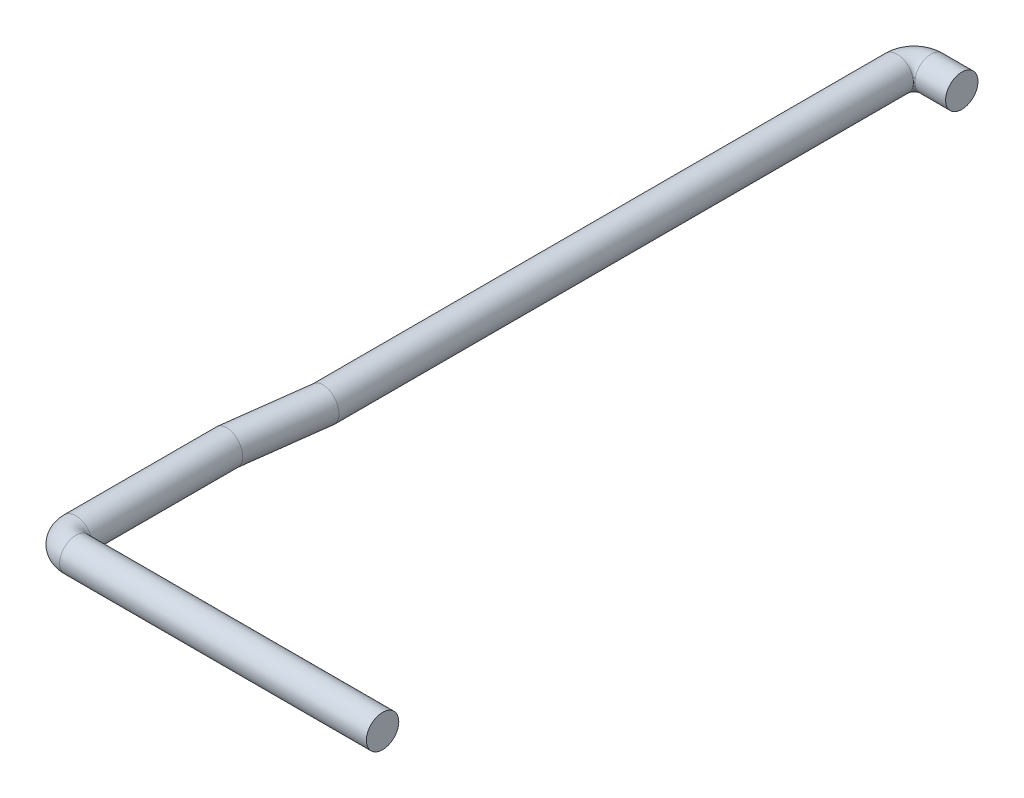
ISO-10303-21;
HEADER;
FILE_DESCRIPTION(('STEP AP214'),'2;1');
FILE_NAME('part.step','',(''),(''),'','','');
FILE_SCHEMA(('AUTOMOTIVE_DESIGN { 1 0 10303 214 1 1 1 1 }'));
ENDSEC;
DATA;
#1=APPLICATION_CONTEXT('core data for automotive mechanical design processes');
#2=APPLICATION_PROTOCOL_DEFINITION('international standard','automotive_design',2000,#1);
#3=PRODUCT_CONTEXT('',#1,'mechanical');
#4=PRODUCT('Part','Part','',(#3));
#5=PRODUCT_RELATED_PRODUCT_CATEGORY('part','',(#4));
#6=PRODUCT_DEFINITION_FORMATION('','',#4);
#7=PRODUCT_DEFINITION_CONTEXT('part definition',#1,'design');
#8=PRODUCT_DEFINITION('design','',#6,#7);
#9=PRODUCT_DEFINITION_SHAPE('','',#8);
#10=(LENGTH_UNIT() NAMED_UNIT(*) SI_UNIT(.MILLI.,.METRE.));
#11=(NAMED_UNIT(*) PLANE_ANGLE_UNIT() SI_UNIT($,.RADIAN.));
#12=(NAMED_UNIT(*) SI_UNIT($,.STERADIAN.) SOLID_ANGLE_UNIT());
#13=UNCERTAINTY_MEASURE_WITH_UNIT(LENGTH_MEASURE(1.E-05),#10,'distance_accuracy_value','');
#14=(GEOMETRIC_REPRESENTATION_CONTEXT(3) GLOBAL_UNCERTAINTY_ASSIGNED_CONTEXT((#13)) GLOBAL_UNIT_ASSIGNED_CONTEXT((#10,
#11,#12)) REPRESENTATION_CONTEXT('',''));
#15=CARTESIAN_POINT('',(0.,0.,0.));
#16=DIRECTION('',(0.,0.,1.));
#17=DIRECTION('',(1.,0.,0.));
#18=AXIS2_PLACEMENT_3D('',#15,#16,#17);
#19=CARTESIAN_POINT('',(-20.0210974306134,13.2106145917647,-0.696707328205521));
#20=DIRECTION('',(0.,-1.,0.));
#21=DIRECTION('',(0.707106781186548,0.,0.707106781186548));
#22=AXIS2_PLACEMENT_3D('',#19,#20,#21);
#23=TOROIDAL_SURFACE('',#22,0.104180843012458,0.0999);
#24=CARTESIAN_POINT('',(-20.0210974306134,13.2106145917647,-0.592526485193063));
#25=DIRECTION('',(-1.,0.,0.));
#26=DIRECTION('',(0.,0.,1.));
#27=AXIS2_PLACEMENT_3D('',#24,#25,#26);
#28=CIRCLE('',#27,0.0999);
#29=CARTESIAN_POINT('',(-20.0210974306134,13.2106145917647,-0.692426485193064));
#30=VERTEX_POINT('',#29);
#31=EDGE_CURVE('E11',#30,#30,#28,.T.);
#32=ORIENTED_EDGE('',*,*,#31,.T.);
#33=EDGE_LOOP('',(#32));
#34=FACE_BOUND('',#33,.T.);
#35=CARTESIAN_POINT('',(-20.1252782736259,13.2106145917647,-0.696707328205516));
#36=DIRECTION('',(0.,0.,-1.));
#37=DIRECTION('',(-1.,0.,0.));
#38=AXIS2_PLACEMENT_3D('',#35,#36,#37);
#39=CIRCLE('',#38,0.0999);
#40=CARTESIAN_POINT('',(-20.0253782736259,13.2106145917647,-0.696707328205519));
#41=VERTEX_POINT('',#40);
#42=EDGE_CURVE('E69',#41,#41,#39,.T.);
#43=ORIENTED_EDGE('',*,*,#42,.F.);
#44=EDGE_LOOP('',(#43));
#45=FACE_BOUND('',#44,.T.);
#46=ADVANCED_FACE('F16',(#34,#45),#23,.T.);
#47=CARTESIAN_POINT('',(-19.9532815094506,13.2106145917647,-5.68973927889833));
#48=DIRECTION('',(0.,-1.,0.));
#49=DIRECTION('',(0.707106781186548,0.,0.707106781186548));
#50=AXIS2_PLACEMENT_3D('',#47,#48,#49);
#51=TOROIDAL_SURFACE('',#50,0.104180843012454,0.0999);
#52=CARTESIAN_POINT('',(-20.0574623524631,13.2106145917647,-5.68973927889833));
#53=DIRECTION('',(0.,0.,1.));
#54=DIRECTION('',(-1.,0.,0.));
#55=AXIS2_PLACEMENT_3D('',#52,#53,#54);
#56=CIRCLE('',#55,0.0999);
#57=CARTESIAN_POINT('',(-19.9575623524631,13.2106145917647,-5.68973927889833));
#58=VERTEX_POINT('',#57);
#59=EDGE_CURVE('E62',#58,#58,#56,.T.);
#60=ORIENTED_EDGE('',*,*,#59,.F.);
#61=EDGE_LOOP('',(#60));
#62=FACE_BOUND('',#61,.T.);
#63=CARTESIAN_POINT('',(-19.9532815094506,13.2106145917647,-5.79392012191078));
#64=DIRECTION('',(-1.,0.,0.));
#65=DIRECTION('',(0.,0.,-1.));
#66=AXIS2_PLACEMENT_3D('',#63,#64,#65);
#67=CIRCLE('',#66,0.0999);
#68=CARTESIAN_POINT('',(-19.9532815094506,13.2106145917647,-5.69402012191078));
#69=VERTEX_POINT('',#68);
#70=EDGE_CURVE('E26',#69,#69,#67,.T.);
#71=ORIENTED_EDGE('',*,*,#70,.T.);
#72=EDGE_LOOP('',(#71));
#73=FACE_BOUND('',#72,.T.);
#74=ADVANCED_FACE('F100',(#62,#73),#51,.T.);
#75=CARTESIAN_POINT('',(-20.0210974306134,13.2106145917647,-0.592526485193063));
#76=DIRECTION('',(1.,0.,0.));
#77=DIRECTION('',(0.,0.,-1.));
#78=AXIS2_PLACEMENT_3D('',#75,#76,#77);
#79=CYLINDRICAL_SURFACE('',#78,0.0999);
#80=ORIENTED_EDGE('',*,*,#31,.F.);
#81=EDGE_LOOP('',(#80));
#82=FACE_BOUND('',#81,.T.);
#83=CARTESIAN_POINT('',(-18.1310974306134,13.2106145917647,-0.592526485193063));
#84=DIRECTION('',(-1.,0.,0.));
#85=DIRECTION('',(0.,0.,1.));
#86=AXIS2_PLACEMENT_3D('',#83,#84,#85);
#87=CIRCLE('',#86,0.0999);
#88=CARTESIAN_POINT('',(-18.1310974306134,13.2106145917647,-0.692426485193063));
#89=VERTEX_POINT('',#88);
#90=EDGE_CURVE('E72',#89,#89,#87,.T.);
#91=ORIENTED_EDGE('',*,*,#90,.T.);
#92=EDGE_LOOP('',(#91));
#93=FACE_BOUND('',#92,.T.);
#94=ADVANCED_FACE('F106',(#82,#93),#79,.T.);
#95=CARTESIAN_POINT('',(-20.1252782736259,13.2106145917647,-0.696707328205516));
#96=DIRECTION('',(0.,0.,-1.));
#97=DIRECTION('',(-1.,0.,0.));
#98=AXIS2_PLACEMENT_3D('',#95,#96,#97);
#99=CYLINDRICAL_SURFACE('',#98,0.0999);
#100=ORIENTED_EDGE('',*,*,#42,.T.);
#101=EDGE_LOOP('',(#100));
#102=FACE_BOUND('',#101,.T.);
#103=CARTESIAN_POINT('',(-20.1252782736259,13.2106145917647,-1.63151141974498));
#104=DIRECTION('',(-0.0641701719678457,0.,0.997938970593702));
#105=DIRECTION('',(0.997938970593702,-2.6885164862641E-11,0.0641701719678457));
#106=AXIS2_PLACEMENT_3D('',#103,#104,#105);
#107=ELLIPSE('',#106,0.10010632207355,0.0999000000000053);
#108=CARTESIAN_POINT('',(-20.1252782736259,13.3105145917647,-1.63151141974498));
#109=VERTEX_POINT('',#108);
#110=CARTESIAN_POINT('',(-20.1252782736259,13.1107145917647,-1.63151141974498));
#111=VERTEX_POINT('',#110);
#112=EDGE_CURVE('E75',#109,#111,#107,.T.);
#113=ORIENTED_EDGE('',*,*,#112,.T.);
#114=CARTESIAN_POINT('',(-20.1252782736259,13.2106145917647,-1.63151141974498));
#115=DIRECTION('',(-0.0641701719678457,0.,0.997938970593702));
#116=DIRECTION('',(0.997938970593702,-2.6885164862641E-11,0.0641701719678457));
#117=AXIS2_PLACEMENT_3D('',#114,#115,#116);
#118=ELLIPSE('',#117,0.10010632207355,0.0999000000000053);
#119=EDGE_CURVE('E77',#111,#109,#118,.T.);
#120=ORIENTED_EDGE('',*,*,#119,.T.);
#121=EDGE_LOOP('',(#113,#120));
#122=FACE_BOUND('',#121,.T.);
#123=ADVANCED_FACE('F82',(#102,#122),#99,.T.);
#124=CARTESIAN_POINT('',(-20.1252782736259,13.2106145917647,-1.63151141974498));
#125=DIRECTION('',(0.128075830712818,0.,-0.991764378059235));
#126=DIRECTION('',(-0.991764378059235,0.,-0.128075830712818));
#127=AXIS2_PLACEMENT_3D('',#124,#125,#126);
#128=CYLINDRICAL_SURFACE('',#127,0.0999);
#129=ORIENTED_EDGE('',*,*,#112,.F.);
#130=ORIENTED_EDGE('',*,*,#119,.F.);
#131=EDGE_LOOP('',(#129,#130));
#132=FACE_BOUND('',#131,.T.);
#133=CARTESIAN_POINT('',(-20.0574623524631,13.2106145917647,-2.1566488676159));
#134=DIRECTION('',(0.0641701719678422,0.,-0.997938970593702));
#135=DIRECTION('',(0.997938970593702,-1.79319938301471E-11,0.0641701719678422));
#136=AXIS2_PLACEMENT_3D('',#133,#134,#135);
#137=ELLIPSE('',#136,0.10010632207355,0.0999000000000127);
#138=CARTESIAN_POINT('',(-20.0574623524631,13.1107145917646,-2.1566488676159));
#139=VERTEX_POINT('',#138);
#140=CARTESIAN_POINT('',(-20.0574623524631,13.3105145917647,-2.1566488676159));
#141=VERTEX_POINT('',#140);
#142=EDGE_CURVE('E56',#139,#141,#137,.T.);
#143=ORIENTED_EDGE('',*,*,#142,.F.);
#144=CARTESIAN_POINT('',(-20.0574623524631,13.2106145917647,-2.1566488676159));
#145=DIRECTION('',(0.0641701719678422,0.,-0.997938970593702));
#146=DIRECTION('',(0.997938970593702,-1.79319938301471E-11,0.0641701719678422));
#147=AXIS2_PLACEMENT_3D('',#144,#145,#146);
#148=ELLIPSE('',#147,0.10010632207355,0.0999000000000127);
#149=EDGE_CURVE('E64',#141,#139,#148,.T.);
#150=ORIENTED_EDGE('',*,*,#149,.F.);
#151=EDGE_LOOP('',(#143,#150));
#152=FACE_BOUND('',#151,.T.);
#153=ADVANCED_FACE('F84',(#132,#152),#128,.T.);
#154=CARTESIAN_POINT('',(-20.0574623524631,13.2106145917647,-2.1566488676159));
#155=DIRECTION('',(0.,0.,-1.));
#156=DIRECTION('',(-1.,0.,0.));
#157=AXIS2_PLACEMENT_3D('',#154,#155,#156);
#158=CYLINDRICAL_SURFACE('',#157,0.0999);
#159=ORIENTED_EDGE('',*,*,#142,.T.);
#160=ORIENTED_EDGE('',*,*,#149,.T.);
#161=EDGE_LOOP('',(#159,#160));
#162=FACE_BOUND('',#161,.T.);
#163=ORIENTED_EDGE('',*,*,#59,.T.);
#164=EDGE_LOOP('',(#163));
#165=FACE_BOUND('',#164,.T.);
#166=ADVANCED_FACE('F87',(#162,#165),#158,.T.);
#167=CARTESIAN_POINT('',(-19.9532815094506,13.2106145917647,-5.79392012191078));
#168=DIRECTION('',(1.,0.,0.));
#169=DIRECTION('',(0.,0.,-1.));
#170=AXIS2_PLACEMENT_3D('',#167,#168,#169);
#171=CYLINDRICAL_SURFACE('',#170,0.0999);
#172=ORIENTED_EDGE('',*,*,#70,.F.);
#173=EDGE_LOOP('',(#172));
#174=FACE_BOUND('',#173,.T.);
#175=CARTESIAN_POINT('',(-19.7632815094506,13.2106145917647,-5.79392012191078));
#176=DIRECTION('',(-1.,0.,0.));
#177=DIRECTION('',(0.,0.,-1.));
#178=AXIS2_PLACEMENT_3D('',#175,#176,#177);
#179=CIRCLE('',#178,0.0999);
#180=CARTESIAN_POINT('',(-19.7632815094506,13.2106145917647,-5.89382012191078));
#181=VERTEX_POINT('',#180);
#182=EDGE_CURVE('E20',#181,#181,#179,.T.);
#183=ORIENTED_EDGE('',*,*,#182,.T.);
#184=EDGE_LOOP('',(#183));
#185=FACE_BOUND('',#184,.T.);
#186=ADVANCED_FACE('F90',(#174,#185),#171,.T.);
#187=CARTESIAN_POINT('',(-18.1310974306134,13.2106145917647,-0.592526485193063));
#188=DIRECTION('',(-1.,0.,0.));
#189=DIRECTION('',(0.,0.707106781186548,0.707106781186548));
#190=AXIS2_PLACEMENT_3D('',#187,#188,#189);
#191=PLANE('',#190);
#192=ORIENTED_EDGE('',*,*,#90,.F.);
#193=EDGE_LOOP('',(#192));
#194=FACE_BOUND('',#193,.T.);
#195=ADVANCED_FACE('F96',(#194),#191,.F.);
#196=CARTESIAN_POINT('',(-19.7632815094506,13.2106145917647,-5.79392012191078));
#197=DIRECTION('',(1.,0.,0.));
#198=DIRECTION('',(0.,0.707106781186548,0.707106781186548));
#199=AXIS2_PLACEMENT_3D('',#196,#197,#198);
#200=PLANE('',#199);
#201=ORIENTED_EDGE('',*,*,#182,.F.);
#202=EDGE_LOOP('',(#201));
#203=FACE_BOUND('',#202,.T.);
#204=ADVANCED_FACE('F18',(#203),#200,.T.);
#205=CLOSED_SHELL('',(#46,#74,#94,#123,#153,#166,#186,#195,#204));
#206=MANIFOLD_SOLID_BREP('B1',#205);
#207=ADVANCED_BREP_SHAPE_REPRESENTATION('',(#18,#206),#14);
#208=SHAPE_DEFINITION_REPRESENTATION(#9,#207);
ENDSEC;
END-ISO-10303-21;
